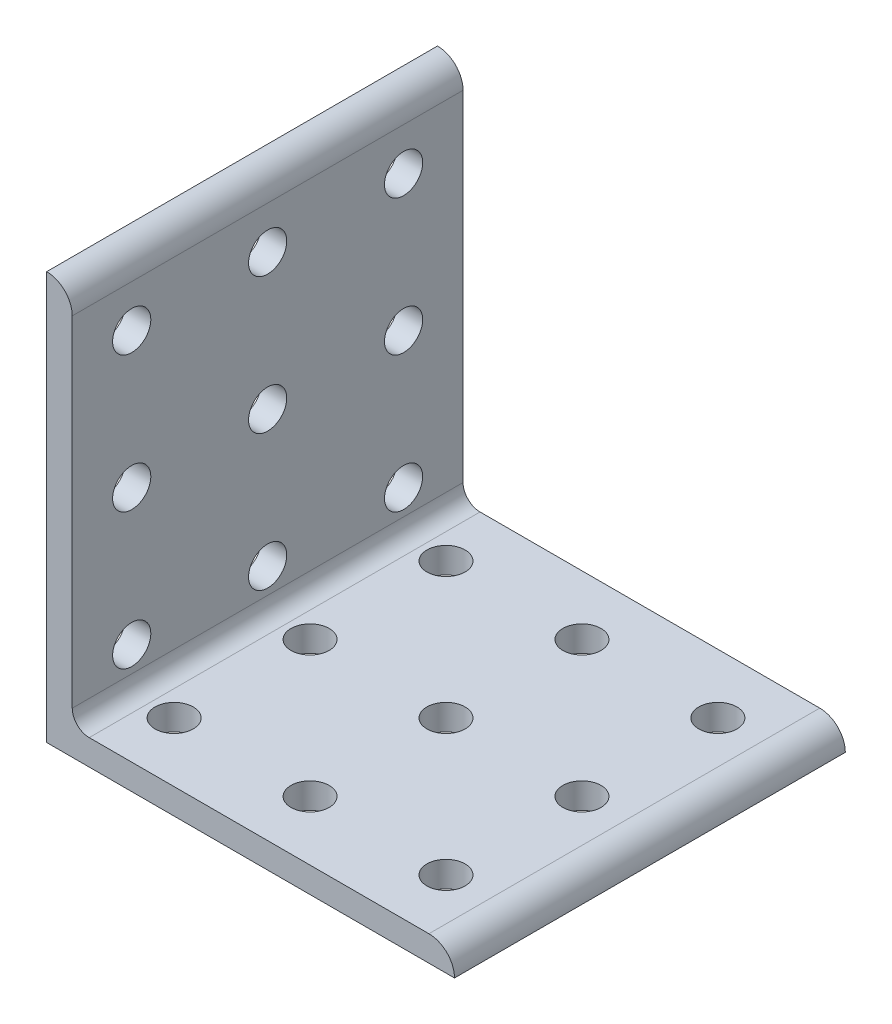
ISO-10303-21;
HEADER;
FILE_DESCRIPTION(('STEP AP214'),'2;1');
FILE_NAME('part.step','',(''),(''),'','','');
FILE_SCHEMA(('AUTOMOTIVE_DESIGN { 1 0 10303 214 1 1 1 1 }'));
ENDSEC;
DATA;
#1=APPLICATION_CONTEXT('core data for automotive mechanical design processes');
#2=APPLICATION_PROTOCOL_DEFINITION('international standard','automotive_design',2000,#1);
#3=PRODUCT_CONTEXT('',#1,'mechanical');
#4=PRODUCT('Part','Part','',(#3));
#5=PRODUCT_RELATED_PRODUCT_CATEGORY('part','',(#4));
#6=PRODUCT_DEFINITION_FORMATION('','',#4);
#7=PRODUCT_DEFINITION_CONTEXT('part definition',#1,'design');
#8=PRODUCT_DEFINITION('design','',#6,#7);
#9=PRODUCT_DEFINITION_SHAPE('','',#8);
#10=(LENGTH_UNIT() NAMED_UNIT(*) SI_UNIT(.MILLI.,.METRE.));
#11=(NAMED_UNIT(*) PLANE_ANGLE_UNIT() SI_UNIT($,.RADIAN.));
#12=(NAMED_UNIT(*) SI_UNIT($,.STERADIAN.) SOLID_ANGLE_UNIT());
#13=UNCERTAINTY_MEASURE_WITH_UNIT(LENGTH_MEASURE(1.E-05),#10,'distance_accuracy_value','');
#14=(GEOMETRIC_REPRESENTATION_CONTEXT(3) GLOBAL_UNCERTAINTY_ASSIGNED_CONTEXT((#13)) GLOBAL_UNIT_ASSIGNED_CONTEXT((#10,
#11,#12)) REPRESENTATION_CONTEXT('',''));
#15=CARTESIAN_POINT('',(0.,0.,0.));
#16=DIRECTION('',(0.,0.,1.));
#17=DIRECTION('',(1.,0.,0.));
#18=AXIS2_PLACEMENT_3D('',#15,#16,#17);
#19=CARTESIAN_POINT('',(-38.1,33.3248,-36.5125));
#20=DIRECTION('',(0.,0.,1.));
#21=DIRECTION('',(1.,0.,0.));
#22=AXIS2_PLACEMENT_3D('',#19,#20,#21);
#23=CYLINDRICAL_SURFACE('',#22,4.77519999999999);
#24=DIRECTION('',(0.,0.,1.));
#25=VECTOR('',#24,1.);
#26=CARTESIAN_POINT('',(-38.1,38.1,-36.5125));
#27=LINE('',#26,#25);
#28=CARTESIAN_POINT('',(-38.1,38.1,-36.5125));
#29=VERTEX_POINT('',#28);
#30=CARTESIAN_POINT('',(-38.1,38.1,36.5125));
#31=VERTEX_POINT('',#30);
#32=EDGE_CURVE('E43',#29,#31,#27,.T.);
#33=ORIENTED_EDGE('',*,*,#32,.T.);
#34=CARTESIAN_POINT('',(-38.1,33.3248,36.5125));
#35=DIRECTION('',(0.,0.,1.));
#36=DIRECTION('',(1.,0.,0.));
#37=AXIS2_PLACEMENT_3D('',#34,#35,#36);
#38=CIRCLE('',#37,4.77519999999999);
#39=CARTESIAN_POINT('',(-33.3248,33.3248,36.5125));
#40=VERTEX_POINT('',#39);
#41=EDGE_CURVE('E104',#40,#31,#38,.T.);
#42=ORIENTED_EDGE('',*,*,#41,.F.);
#43=DIRECTION('',(0.,0.,1.));
#44=VECTOR('',#43,1.);
#45=CARTESIAN_POINT('',(-33.3248,33.3248,-36.5125));
#46=LINE('',#45,#44);
#47=CARTESIAN_POINT('',(-33.3248,33.3248,-36.5125));
#48=VERTEX_POINT('',#47);
#49=EDGE_CURVE('E11',#48,#40,#46,.T.);
#50=ORIENTED_EDGE('',*,*,#49,.F.);
#51=CARTESIAN_POINT('',(-38.1,33.3248,-36.5125));
#52=DIRECTION('',(0.,0.,1.));
#53=DIRECTION('',(1.,0.,0.));
#54=AXIS2_PLACEMENT_3D('',#51,#52,#53);
#55=CIRCLE('',#54,4.77519999999999);
#56=EDGE_CURVE('E105',#48,#29,#55,.T.);
#57=ORIENTED_EDGE('',*,*,#56,.T.);
#58=EDGE_LOOP('',(#33,#42,#50,#57));
#59=FACE_BOUND('',#58,.T.);
#60=ADVANCED_FACE('F40',(#59),#23,.T.);
#61=CARTESIAN_POINT('',(-33.3248,-30.1498,-36.5125));
#62=DIRECTION('',(1.,0.,0.));
#63=DIRECTION('',(0.,1.,0.));
#64=AXIS2_PLACEMENT_3D('',#61,#62,#63);
#65=PLANE('',#64);
#66=CARTESIAN_POINT('',(-33.3248,-25.4,0.));
#67=DIRECTION('',(1.,0.,0.));
#68=DIRECTION('',(0.,1.,0.));
#69=AXIS2_PLACEMENT_3D('',#66,#67,#68);
#70=CIRCLE('',#69,3.5687);
#71=CARTESIAN_POINT('',(-33.3248,-21.8313,0.));
#72=VERTEX_POINT('',#71);
#73=EDGE_CURVE('E220',#72,#72,#70,.T.);
#74=ORIENTED_EDGE('',*,*,#73,.F.);
#75=EDGE_LOOP('',(#74));
#76=FACE_BOUND('',#75,.T.);
#77=CARTESIAN_POINT('',(-33.3248,-25.4,-25.4));
#78=DIRECTION('',(1.,0.,0.));
#79=DIRECTION('',(0.,1.,0.));
#80=AXIS2_PLACEMENT_3D('',#77,#78,#79);
#81=CIRCLE('',#80,3.5687);
#82=CARTESIAN_POINT('',(-33.3248,-21.8313,-25.4));
#83=VERTEX_POINT('',#82);
#84=EDGE_CURVE('E186',#83,#83,#81,.T.);
#85=ORIENTED_EDGE('',*,*,#84,.F.);
#86=EDGE_LOOP('',(#85));
#87=FACE_BOUND('',#86,.T.);
#88=CARTESIAN_POINT('',(-33.3248,0.,0.));
#89=DIRECTION('',(1.,0.,0.));
#90=DIRECTION('',(0.,1.,0.));
#91=AXIS2_PLACEMENT_3D('',#88,#89,#90);
#92=CIRCLE('',#91,3.5687);
#93=CARTESIAN_POINT('',(-33.3248,3.56869999999999,0.));
#94=VERTEX_POINT('',#93);
#95=EDGE_CURVE('E187',#94,#94,#92,.T.);
#96=ORIENTED_EDGE('',*,*,#95,.F.);
#97=EDGE_LOOP('',(#96));
#98=FACE_BOUND('',#97,.T.);
#99=CARTESIAN_POINT('',(-33.3248,0.,-25.3999999999999));
#100=DIRECTION('',(1.,0.,0.));
#101=DIRECTION('',(0.,1.,0.));
#102=AXIS2_PLACEMENT_3D('',#99,#100,#101);
#103=CIRCLE('',#102,3.5687);
#104=CARTESIAN_POINT('',(-33.3248,3.56869999999999,-25.3999999999999));
#105=VERTEX_POINT('',#104);
#106=EDGE_CURVE('E230',#105,#105,#103,.T.);
#107=ORIENTED_EDGE('',*,*,#106,.F.);
#108=EDGE_LOOP('',(#107));
#109=FACE_BOUND('',#108,.T.);
#110=CARTESIAN_POINT('',(-33.3248,25.4,1.76941794549634E-13));
#111=DIRECTION('',(1.,0.,0.));
#112=DIRECTION('',(0.,1.,0.));
#113=AXIS2_PLACEMENT_3D('',#110,#111,#112);
#114=CIRCLE('',#113,3.5687);
#115=CARTESIAN_POINT('',(-33.3248,28.9687,1.76941794549634E-13));
#116=VERTEX_POINT('',#115);
#117=EDGE_CURVE('E177',#116,#116,#114,.T.);
#118=ORIENTED_EDGE('',*,*,#117,.F.);
#119=EDGE_LOOP('',(#118));
#120=FACE_BOUND('',#119,.T.);
#121=CARTESIAN_POINT('',(-33.3248,25.4,-25.3999999999998));
#122=DIRECTION('',(1.,0.,0.));
#123=DIRECTION('',(0.,1.,0.));
#124=AXIS2_PLACEMENT_3D('',#121,#122,#123);
#125=CIRCLE('',#124,3.5687);
#126=CARTESIAN_POINT('',(-33.3248,28.9687,-25.3999999999998));
#127=VERTEX_POINT('',#126);
#128=EDGE_CURVE('E196',#127,#127,#125,.T.);
#129=ORIENTED_EDGE('',*,*,#128,.F.);
#130=EDGE_LOOP('',(#129));
#131=FACE_BOUND('',#130,.T.);
#132=CARTESIAN_POINT('',(-33.3248,0.,25.4000000000001));
#133=DIRECTION('',(1.,0.,0.));
#134=DIRECTION('',(0.,1.,0.));
#135=AXIS2_PLACEMENT_3D('',#132,#133,#134);
#136=CIRCLE('',#135,3.5687);
#137=CARTESIAN_POINT('',(-33.3248,3.56869999999999,25.4000000000001));
#138=VERTEX_POINT('',#137);
#139=EDGE_CURVE('E204',#138,#138,#136,.T.);
#140=ORIENTED_EDGE('',*,*,#139,.F.);
#141=EDGE_LOOP('',(#140));
#142=FACE_BOUND('',#141,.T.);
#143=CARTESIAN_POINT('',(-33.3248,25.4,25.4000000000002));
#144=DIRECTION('',(1.,0.,0.));
#145=DIRECTION('',(0.,1.,0.));
#146=AXIS2_PLACEMENT_3D('',#143,#144,#145);
#147=CIRCLE('',#146,3.5687);
#148=CARTESIAN_POINT('',(-33.3248,28.9687,25.4000000000002));
#149=VERTEX_POINT('',#148);
#150=EDGE_CURVE('E213',#149,#149,#147,.T.);
#151=ORIENTED_EDGE('',*,*,#150,.F.);
#152=EDGE_LOOP('',(#151));
#153=FACE_BOUND('',#152,.T.);
#154=CARTESIAN_POINT('',(-33.3248,-25.4,25.4));
#155=DIRECTION('',(1.,0.,0.));
#156=DIRECTION('',(0.,1.,0.));
#157=AXIS2_PLACEMENT_3D('',#154,#155,#156);
#158=CIRCLE('',#157,3.5687);
#159=CARTESIAN_POINT('',(-33.3248,-21.8313,25.4));
#160=VERTEX_POINT('',#159);
#161=EDGE_CURVE('E129',#160,#160,#158,.T.);
#162=ORIENTED_EDGE('',*,*,#161,.F.);
#163=EDGE_LOOP('',(#162));
#164=FACE_BOUND('',#163,.T.);
#165=ORIENTED_EDGE('',*,*,#49,.T.);
#166=DIRECTION('',(0.,1.,0.));
#167=VECTOR('',#166,1.);
#168=CARTESIAN_POINT('',(-33.3248,-30.1498,36.5125));
#169=LINE('',#168,#167);
#170=CARTESIAN_POINT('',(-33.3248,-30.1498,36.5125));
#171=VERTEX_POINT('',#170);
#172=EDGE_CURVE('E124',#171,#40,#169,.T.);
#173=ORIENTED_EDGE('',*,*,#172,.F.);
#174=DIRECTION('',(0.,0.,1.));
#175=VECTOR('',#174,1.);
#176=CARTESIAN_POINT('',(-33.3248,-30.1498,-36.5125));
#177=LINE('',#176,#175);
#178=CARTESIAN_POINT('',(-33.3248,-30.1498,-36.5125));
#179=VERTEX_POINT('',#178);
#180=EDGE_CURVE('E49',#179,#171,#177,.T.);
#181=ORIENTED_EDGE('',*,*,#180,.F.);
#182=DIRECTION('',(0.,1.,0.));
#183=VECTOR('',#182,1.);
#184=CARTESIAN_POINT('',(-33.3248,-30.1498,-36.5125));
#185=LINE('',#184,#183);
#186=EDGE_CURVE('E111',#179,#48,#185,.T.);
#187=ORIENTED_EDGE('',*,*,#186,.T.);
#188=EDGE_LOOP('',(#165,#173,#181,#187));
#189=FACE_BOUND('',#188,.T.);
#190=ADVANCED_FACE('F340',(#76,#87,#98,#109,#120,#131,#142,#153,#164,#189),#65,.T.);
#191=CARTESIAN_POINT('',(-30.1498,-30.1498,-36.5125));
#192=DIRECTION('',(0.,0.,1.));
#193=DIRECTION('',(1.,0.,0.));
#194=AXIS2_PLACEMENT_3D('',#191,#192,#193);
#195=CYLINDRICAL_SURFACE('',#194,3.175);
#196=ORIENTED_EDGE('',*,*,#180,.T.);
#197=CARTESIAN_POINT('',(-30.1498,-30.1498,36.5125));
#198=DIRECTION('',(0.,0.,-1.));
#199=DIRECTION('',(-1.,0.,0.));
#200=AXIS2_PLACEMENT_3D('',#197,#198,#199);
#201=CIRCLE('',#200,3.175);
#202=CARTESIAN_POINT('',(-30.1498,-33.3248,36.5125));
#203=VERTEX_POINT('',#202);
#204=EDGE_CURVE('E142',#203,#171,#201,.T.);
#205=ORIENTED_EDGE('',*,*,#204,.F.);
#206=DIRECTION('',(0.,0.,1.));
#207=VECTOR('',#206,1.);
#208=CARTESIAN_POINT('',(-30.1498,-33.3248,-36.5125));
#209=LINE('',#208,#207);
#210=CARTESIAN_POINT('',(-30.1498,-33.3248,-36.5125));
#211=VERTEX_POINT('',#210);
#212=EDGE_CURVE('E169',#211,#203,#209,.T.);
#213=ORIENTED_EDGE('',*,*,#212,.F.);
#214=CARTESIAN_POINT('',(-30.1498,-30.1498,-36.5125));
#215=DIRECTION('',(0.,0.,-1.));
#216=DIRECTION('',(-1.,0.,0.));
#217=AXIS2_PLACEMENT_3D('',#214,#215,#216);
#218=CIRCLE('',#217,3.175);
#219=EDGE_CURVE('E163',#211,#179,#218,.T.);
#220=ORIENTED_EDGE('',*,*,#219,.T.);
#221=EDGE_LOOP('',(#196,#205,#213,#220));
#222=FACE_BOUND('',#221,.T.);
#223=ADVANCED_FACE('F320',(#222),#195,.F.);
#224=CARTESIAN_POINT('',(33.3248,-33.3248,-36.5125));
#225=DIRECTION('',(0.,1.,0.));
#226=DIRECTION('',(-1.,0.,0.));
#227=AXIS2_PLACEMENT_3D('',#224,#225,#226);
#228=PLANE('',#227);
#229=CARTESIAN_POINT('',(0.,-33.3248,25.4));
#230=DIRECTION('',(0.,1.,0.));
#231=DIRECTION('',(-1.,0.,0.));
#232=AXIS2_PLACEMENT_3D('',#229,#230,#231);
#233=CIRCLE('',#232,3.5687);
#234=CARTESIAN_POINT('',(-3.5687,-33.3248,25.4));
#235=VERTEX_POINT('',#234);
#236=EDGE_CURVE('E270',#235,#235,#233,.T.);
#237=ORIENTED_EDGE('',*,*,#236,.F.);
#238=EDGE_LOOP('',(#237));
#239=FACE_BOUND('',#238,.T.);
#240=CARTESIAN_POINT('',(25.4,-33.3248,25.4));
#241=DIRECTION('',(0.,1.,0.));
#242=DIRECTION('',(-1.,0.,0.));
#243=AXIS2_PLACEMENT_3D('',#240,#241,#242);
#244=CIRCLE('',#243,3.5687);
#245=CARTESIAN_POINT('',(21.8313,-33.3248,25.4));
#246=VERTEX_POINT('',#245);
#247=EDGE_CURVE('E264',#246,#246,#244,.T.);
#248=ORIENTED_EDGE('',*,*,#247,.F.);
#249=EDGE_LOOP('',(#248));
#250=FACE_BOUND('',#249,.T.);
#251=CARTESIAN_POINT('',(0.,-33.3248,0.));
#252=DIRECTION('',(0.,1.,0.));
#253=DIRECTION('',(-1.,0.,0.));
#254=AXIS2_PLACEMENT_3D('',#251,#252,#253);
#255=CIRCLE('',#254,3.5687);
#256=CARTESIAN_POINT('',(-3.56870000000009,-33.3248,0.));
#257=VERTEX_POINT('',#256);
#258=EDGE_CURVE('E256',#257,#257,#255,.T.);
#259=ORIENTED_EDGE('',*,*,#258,.F.);
#260=EDGE_LOOP('',(#259));
#261=FACE_BOUND('',#260,.T.);
#262=CARTESIAN_POINT('',(25.3999999999999,-33.3248,0.));
#263=DIRECTION('',(0.,1.,0.));
#264=DIRECTION('',(-1.,0.,0.));
#265=AXIS2_PLACEMENT_3D('',#262,#263,#264);
#266=CIRCLE('',#265,3.5687);
#267=CARTESIAN_POINT('',(21.8312999999999,-33.3248,0.));
#268=VERTEX_POINT('',#267);
#269=EDGE_CURVE('E249',#268,#268,#266,.T.);
#270=ORIENTED_EDGE('',*,*,#269,.F.);
#271=EDGE_LOOP('',(#270));
#272=FACE_BOUND('',#271,.T.);
#273=CARTESIAN_POINT('',(-1.76941794549634E-13,-33.3248,-25.4));
#274=DIRECTION('',(0.,1.,0.));
#275=DIRECTION('',(-1.,0.,0.));
#276=AXIS2_PLACEMENT_3D('',#273,#274,#275);
#277=CIRCLE('',#276,3.5687);
#278=CARTESIAN_POINT('',(-3.56870000000018,-33.3248,-25.4));
#279=VERTEX_POINT('',#278);
#280=EDGE_CURVE('E297',#279,#279,#277,.T.);
#281=ORIENTED_EDGE('',*,*,#280,.F.);
#282=EDGE_LOOP('',(#281));
#283=FACE_BOUND('',#282,.T.);
#284=CARTESIAN_POINT('',(25.3999999999998,-33.3248,-25.4));
#285=DIRECTION('',(0.,1.,0.));
#286=DIRECTION('',(-1.,0.,0.));
#287=AXIS2_PLACEMENT_3D('',#284,#285,#286);
#288=CIRCLE('',#287,3.5687);
#289=CARTESIAN_POINT('',(21.8312999999998,-33.3248,-25.4));
#290=VERTEX_POINT('',#289);
#291=EDGE_CURVE('E291',#290,#290,#288,.T.);
#292=ORIENTED_EDGE('',*,*,#291,.F.);
#293=EDGE_LOOP('',(#292));
#294=FACE_BOUND('',#293,.T.);
#295=CARTESIAN_POINT('',(-25.4000000000001,-33.3248,0.));
#296=DIRECTION('',(0.,1.,0.));
#297=DIRECTION('',(-1.,0.,0.));
#298=AXIS2_PLACEMENT_3D('',#295,#296,#297);
#299=CIRCLE('',#298,3.5687);
#300=CARTESIAN_POINT('',(-28.9687000000001,-33.3248,0.));
#301=VERTEX_POINT('',#300);
#302=EDGE_CURVE('E283',#301,#301,#299,.T.);
#303=ORIENTED_EDGE('',*,*,#302,.F.);
#304=EDGE_LOOP('',(#303));
#305=FACE_BOUND('',#304,.T.);
#306=CARTESIAN_POINT('',(-25.4000000000002,-33.3248,-25.4));
#307=DIRECTION('',(0.,1.,0.));
#308=DIRECTION('',(-1.,0.,0.));
#309=AXIS2_PLACEMENT_3D('',#306,#307,#308);
#310=CIRCLE('',#309,3.5687);
#311=CARTESIAN_POINT('',(-28.9687000000002,-33.3248,-25.4));
#312=VERTEX_POINT('',#311);
#313=EDGE_CURVE('E277',#312,#312,#310,.T.);
#314=ORIENTED_EDGE('',*,*,#313,.F.);
#315=EDGE_LOOP('',(#314));
#316=FACE_BOUND('',#315,.T.);
#317=CARTESIAN_POINT('',(-25.4,-33.3248,25.4));
#318=DIRECTION('',(0.,1.,0.));
#319=DIRECTION('',(-1.,0.,0.));
#320=AXIS2_PLACEMENT_3D('',#317,#318,#319);
#321=CIRCLE('',#320,3.5687);
#322=CARTESIAN_POINT('',(-28.9687,-33.3248,25.4));
#323=VERTEX_POINT('',#322);
#324=EDGE_CURVE('E241',#323,#323,#321,.T.);
#325=ORIENTED_EDGE('',*,*,#324,.F.);
#326=EDGE_LOOP('',(#325));
#327=FACE_BOUND('',#326,.T.);
#328=ORIENTED_EDGE('',*,*,#212,.T.);
#329=DIRECTION('',(-1.,0.,0.));
#330=VECTOR('',#329,1.);
#331=CARTESIAN_POINT('',(33.3248,-33.3248,36.5125));
#332=LINE('',#331,#330);
#333=CARTESIAN_POINT('',(33.3248,-33.3248,36.5125));
#334=VERTEX_POINT('',#333);
#335=EDGE_CURVE('E138',#334,#203,#332,.T.);
#336=ORIENTED_EDGE('',*,*,#335,.F.);
#337=DIRECTION('',(0.,0.,1.));
#338=VECTOR('',#337,1.);
#339=CARTESIAN_POINT('',(33.3248,-33.3248,-36.5125));
#340=LINE('',#339,#338);
#341=CARTESIAN_POINT('',(33.3248,-33.3248,-36.5125));
#342=VERTEX_POINT('',#341);
#343=EDGE_CURVE('E172',#342,#334,#340,.T.);
#344=ORIENTED_EDGE('',*,*,#343,.F.);
#345=DIRECTION('',(-1.,0.,0.));
#346=VECTOR('',#345,1.);
#347=CARTESIAN_POINT('',(33.3248,-33.3248,-36.5125));
#348=LINE('',#347,#346);
#349=EDGE_CURVE('E159',#342,#211,#348,.T.);
#350=ORIENTED_EDGE('',*,*,#349,.T.);
#351=EDGE_LOOP('',(#328,#336,#344,#350));
#352=FACE_BOUND('',#351,.T.);
#353=ADVANCED_FACE('F316',(#239,#250,#261,#272,#283,#294,#305,#316,#327,#352),#228,.T.);
#354=CARTESIAN_POINT('',(33.3248,-38.1,-36.5125));
#355=DIRECTION('',(0.,0.,1.));
#356=DIRECTION('',(1.,0.,0.));
#357=AXIS2_PLACEMENT_3D('',#354,#355,#356);
#358=CYLINDRICAL_SURFACE('',#357,4.77519999999998);
#359=ORIENTED_EDGE('',*,*,#343,.T.);
#360=CARTESIAN_POINT('',(33.3248,-38.1,36.5125));
#361=DIRECTION('',(0.,0.,1.));
#362=DIRECTION('',(-1.,0.,0.));
#363=AXIS2_PLACEMENT_3D('',#360,#361,#362);
#364=CIRCLE('',#363,4.77519999999998);
#365=CARTESIAN_POINT('',(38.1,-38.1,36.5125));
#366=VERTEX_POINT('',#365);
#367=EDGE_CURVE('E135',#366,#334,#364,.T.);
#368=ORIENTED_EDGE('',*,*,#367,.F.);
#369=DIRECTION('',(0.,0.,1.));
#370=VECTOR('',#369,1.);
#371=CARTESIAN_POINT('',(38.1,-38.1,-36.5125));
#372=LINE('',#371,#370);
#373=CARTESIAN_POINT('',(38.1,-38.1,-36.5125));
#374=VERTEX_POINT('',#373);
#375=EDGE_CURVE('E174',#374,#366,#372,.T.);
#376=ORIENTED_EDGE('',*,*,#375,.F.);
#377=CARTESIAN_POINT('',(33.3248,-38.1,-36.5125));
#378=DIRECTION('',(0.,0.,1.));
#379=DIRECTION('',(-1.,0.,0.));
#380=AXIS2_PLACEMENT_3D('',#377,#378,#379);
#381=CIRCLE('',#380,4.77519999999998);
#382=EDGE_CURVE('E156',#374,#342,#381,.T.);
#383=ORIENTED_EDGE('',*,*,#382,.T.);
#384=EDGE_LOOP('',(#359,#368,#376,#383));
#385=FACE_BOUND('',#384,.T.);
#386=ADVANCED_FACE('F319',(#385),#358,.T.);
#387=CARTESIAN_POINT('',(-38.1,-38.1,-36.5125));
#388=DIRECTION('',(0.,-1.,0.));
#389=DIRECTION('',(1.,0.,0.));
#390=AXIS2_PLACEMENT_3D('',#387,#388,#389);
#391=PLANE('',#390);
#392=CARTESIAN_POINT('',(0.,-38.1,25.4));
#393=DIRECTION('',(0.,1.,0.));
#394=DIRECTION('',(-1.,0.,0.));
#395=AXIS2_PLACEMENT_3D('',#392,#393,#394);
#396=CIRCLE('',#395,3.5687);
#397=CARTESIAN_POINT('',(-3.5687,-38.1,25.4));
#398=VERTEX_POINT('',#397);
#399=EDGE_CURVE('E245',#398,#398,#396,.T.);
#400=ORIENTED_EDGE('',*,*,#399,.T.);
#401=EDGE_LOOP('',(#400));
#402=FACE_BOUND('',#401,.T.);
#403=CARTESIAN_POINT('',(25.4,-38.1,25.4));
#404=DIRECTION('',(0.,1.,0.));
#405=DIRECTION('',(-1.,0.,0.));
#406=AXIS2_PLACEMENT_3D('',#403,#404,#405);
#407=CIRCLE('',#406,3.5687);
#408=CARTESIAN_POINT('',(21.8313,-38.1,25.4));
#409=VERTEX_POINT('',#408);
#410=EDGE_CURVE('E267',#409,#409,#407,.T.);
#411=ORIENTED_EDGE('',*,*,#410,.T.);
#412=EDGE_LOOP('',(#411));
#413=FACE_BOUND('',#412,.T.);
#414=CARTESIAN_POINT('',(0.,-38.1,0.));
#415=DIRECTION('',(0.,1.,0.));
#416=DIRECTION('',(-1.,0.,0.));
#417=AXIS2_PLACEMENT_3D('',#414,#415,#416);
#418=CIRCLE('',#417,3.5687);
#419=CARTESIAN_POINT('',(-3.56870000000009,-38.1,0.));
#420=VERTEX_POINT('',#419);
#421=EDGE_CURVE('E260',#420,#420,#418,.T.);
#422=ORIENTED_EDGE('',*,*,#421,.T.);
#423=EDGE_LOOP('',(#422));
#424=FACE_BOUND('',#423,.T.);
#425=CARTESIAN_POINT('',(25.3999999999999,-38.1,0.));
#426=DIRECTION('',(0.,1.,0.));
#427=DIRECTION('',(-1.,0.,0.));
#428=AXIS2_PLACEMENT_3D('',#425,#426,#427);
#429=CIRCLE('',#428,3.5687);
#430=CARTESIAN_POINT('',(21.8312999999999,-38.1,0.));
#431=VERTEX_POINT('',#430);
#432=EDGE_CURVE('E252',#431,#431,#429,.T.);
#433=ORIENTED_EDGE('',*,*,#432,.T.);
#434=EDGE_LOOP('',(#433));
#435=FACE_BOUND('',#434,.T.);
#436=CARTESIAN_POINT('',(-1.7641978092261E-13,-38.1,-25.4));
#437=DIRECTION('',(0.,1.,0.));
#438=DIRECTION('',(-1.,0.,0.));
#439=AXIS2_PLACEMENT_3D('',#436,#437,#438);
#440=CIRCLE('',#439,3.5687);
#441=CARTESIAN_POINT('',(-3.56870000000018,-38.1,-25.4));
#442=VERTEX_POINT('',#441);
#443=EDGE_CURVE('E253',#442,#442,#440,.T.);
#444=ORIENTED_EDGE('',*,*,#443,.T.);
#445=EDGE_LOOP('',(#444));
#446=FACE_BOUND('',#445,.T.);
#447=CARTESIAN_POINT('',(25.3999999999998,-38.1,-25.4));
#448=DIRECTION('',(0.,1.,0.));
#449=DIRECTION('',(-1.,0.,0.));
#450=AXIS2_PLACEMENT_3D('',#447,#448,#449);
#451=CIRCLE('',#450,3.5687);
#452=CARTESIAN_POINT('',(21.8312999999998,-38.1,-25.4));
#453=VERTEX_POINT('',#452);
#454=EDGE_CURVE('E294',#453,#453,#451,.T.);
#455=ORIENTED_EDGE('',*,*,#454,.T.);
#456=EDGE_LOOP('',(#455));
#457=FACE_BOUND('',#456,.T.);
#458=CARTESIAN_POINT('',(-25.4000000000001,-38.1,0.));
#459=DIRECTION('',(0.,1.,0.));
#460=DIRECTION('',(-1.,0.,0.));
#461=AXIS2_PLACEMENT_3D('',#458,#459,#460);
#462=CIRCLE('',#461,3.5687);
#463=CARTESIAN_POINT('',(-28.9687000000001,-38.1,0.));
#464=VERTEX_POINT('',#463);
#465=EDGE_CURVE('E287',#464,#464,#462,.T.);
#466=ORIENTED_EDGE('',*,*,#465,.T.);
#467=EDGE_LOOP('',(#466));
#468=FACE_BOUND('',#467,.T.);
#469=CARTESIAN_POINT('',(-25.4000000000002,-38.1,-25.4));
#470=DIRECTION('',(0.,1.,0.));
#471=DIRECTION('',(-1.,0.,0.));
#472=AXIS2_PLACEMENT_3D('',#469,#470,#471);
#473=CIRCLE('',#472,3.5687);
#474=CARTESIAN_POINT('',(-28.9687000000002,-38.1,-25.4));
#475=VERTEX_POINT('',#474);
#476=EDGE_CURVE('E280',#475,#475,#473,.T.);
#477=ORIENTED_EDGE('',*,*,#476,.T.);
#478=EDGE_LOOP('',(#477));
#479=FACE_BOUND('',#478,.T.);
#480=CARTESIAN_POINT('',(-25.4,-38.1,25.4));
#481=DIRECTION('',(0.,1.,0.));
#482=DIRECTION('',(-1.,0.,0.));
#483=AXIS2_PLACEMENT_3D('',#480,#481,#482);
#484=CIRCLE('',#483,3.5687);
#485=CARTESIAN_POINT('',(-28.9687,-38.1,25.4));
#486=VERTEX_POINT('',#485);
#487=EDGE_CURVE('E217',#486,#486,#484,.T.);
#488=ORIENTED_EDGE('',*,*,#487,.T.);
#489=EDGE_LOOP('',(#488));
#490=FACE_BOUND('',#489,.T.);
#491=ORIENTED_EDGE('',*,*,#375,.T.);
#492=DIRECTION('',(1.,0.,0.));
#493=VECTOR('',#492,1.);
#494=CARTESIAN_POINT('',(-38.1,-38.1,36.5125));
#495=LINE('',#494,#493);
#496=CARTESIAN_POINT('',(-38.1,-38.1,36.5125));
#497=VERTEX_POINT('',#496);
#498=EDGE_CURVE('E119',#497,#366,#495,.T.);
#499=ORIENTED_EDGE('',*,*,#498,.F.);
#500=DIRECTION('',(0.,0.,1.));
#501=VECTOR('',#500,1.);
#502=CARTESIAN_POINT('',(-38.1,-38.1,-36.5125));
#503=LINE('',#502,#501);
#504=CARTESIAN_POINT('',(-38.1,-38.1,-36.5125));
#505=VERTEX_POINT('',#504);
#506=EDGE_CURVE('E110',#505,#497,#503,.T.);
#507=ORIENTED_EDGE('',*,*,#506,.F.);
#508=DIRECTION('',(1.,0.,0.));
#509=VECTOR('',#508,1.);
#510=CARTESIAN_POINT('',(-38.1,-38.1,-36.5125));
#511=LINE('',#510,#509);
#512=EDGE_CURVE('E152',#505,#374,#511,.T.);
#513=ORIENTED_EDGE('',*,*,#512,.T.);
#514=EDGE_LOOP('',(#491,#499,#507,#513));
#515=FACE_BOUND('',#514,.T.);
#516=ADVANCED_FACE('F305',(#402,#413,#424,#435,#446,#457,#468,#479,#490,#515),#391,.T.);
#517=CARTESIAN_POINT('',(-38.1,38.1,-36.5125));
#518=DIRECTION('',(-1.,0.,0.));
#519=DIRECTION('',(0.,-1.,0.));
#520=AXIS2_PLACEMENT_3D('',#517,#518,#519);
#521=PLANE('',#520);
#522=CARTESIAN_POINT('',(-38.1,-25.4,0.));
#523=DIRECTION('',(1.,0.,0.));
#524=DIRECTION('',(0.,1.,0.));
#525=AXIS2_PLACEMENT_3D('',#522,#523,#524);
#526=CIRCLE('',#525,3.5687);
#527=CARTESIAN_POINT('',(-38.1,-21.8313,0.));
#528=VERTEX_POINT('',#527);
#529=EDGE_CURVE('E182',#528,#528,#526,.T.);
#530=ORIENTED_EDGE('',*,*,#529,.T.);
#531=EDGE_LOOP('',(#530));
#532=FACE_BOUND('',#531,.T.);
#533=CARTESIAN_POINT('',(-38.1,-25.4,-25.4));
#534=DIRECTION('',(1.,0.,0.));
#535=DIRECTION('',(0.,1.,0.));
#536=AXIS2_PLACEMENT_3D('',#533,#534,#535);
#537=CIRCLE('',#536,3.5687);
#538=CARTESIAN_POINT('',(-38.1,-21.8313,-25.4));
#539=VERTEX_POINT('',#538);
#540=EDGE_CURVE('E223',#539,#539,#537,.T.);
#541=ORIENTED_EDGE('',*,*,#540,.T.);
#542=EDGE_LOOP('',(#541));
#543=FACE_BOUND('',#542,.T.);
#544=CARTESIAN_POINT('',(-38.1,0.,0.));
#545=DIRECTION('',(1.,0.,0.));
#546=DIRECTION('',(0.,1.,0.));
#547=AXIS2_PLACEMENT_3D('',#544,#545,#546);
#548=CIRCLE('',#547,3.5687);
#549=CARTESIAN_POINT('',(-38.1,3.56869999999999,0.));
#550=VERTEX_POINT('',#549);
#551=EDGE_CURVE('E183',#550,#550,#548,.T.);
#552=ORIENTED_EDGE('',*,*,#551,.T.);
#553=EDGE_LOOP('',(#552));
#554=FACE_BOUND('',#553,.T.);
#555=CARTESIAN_POINT('',(-38.1,0.,-25.3999999999999));
#556=DIRECTION('',(1.,0.,0.));
#557=DIRECTION('',(0.,1.,0.));
#558=AXIS2_PLACEMENT_3D('',#555,#556,#557);
#559=CIRCLE('',#558,3.5687);
#560=CARTESIAN_POINT('',(-38.1,3.56869999999999,-25.3999999999999));
#561=VERTEX_POINT('',#560);
#562=EDGE_CURVE('E191',#561,#561,#559,.T.);
#563=ORIENTED_EDGE('',*,*,#562,.T.);
#564=EDGE_LOOP('',(#563));
#565=FACE_BOUND('',#564,.T.);
#566=CARTESIAN_POINT('',(-38.1,25.4,1.76941794549634E-13));
#567=DIRECTION('',(1.,0.,0.));
#568=DIRECTION('',(0.,1.,0.));
#569=AXIS2_PLACEMENT_3D('',#566,#567,#568);
#570=CIRCLE('',#569,3.5687);
#571=CARTESIAN_POINT('',(-38.1,28.9687,1.76941794549634E-13));
#572=VERTEX_POINT('',#571);
#573=EDGE_CURVE('E232',#572,#572,#570,.T.);
#574=ORIENTED_EDGE('',*,*,#573,.T.);
#575=EDGE_LOOP('',(#574));
#576=FACE_BOUND('',#575,.T.);
#577=CARTESIAN_POINT('',(-38.1,25.4,-25.3999999999998));
#578=DIRECTION('',(1.,0.,0.));
#579=DIRECTION('',(0.,1.,0.));
#580=AXIS2_PLACEMENT_3D('',#577,#578,#579);
#581=CIRCLE('',#580,3.5687);
#582=CARTESIAN_POINT('',(-38.1,28.9687,-25.3999999999998));
#583=VERTEX_POINT('',#582);
#584=EDGE_CURVE('E193',#583,#583,#581,.T.);
#585=ORIENTED_EDGE('',*,*,#584,.T.);
#586=EDGE_LOOP('',(#585));
#587=FACE_BOUND('',#586,.T.);
#588=CARTESIAN_POINT('',(-38.1,0.,25.4000000000001));
#589=DIRECTION('',(1.,0.,0.));
#590=DIRECTION('',(0.,1.,0.));
#591=AXIS2_PLACEMENT_3D('',#588,#589,#590);
#592=CIRCLE('',#591,3.5687);
#593=CARTESIAN_POINT('',(-38.1,3.56869999999999,25.4000000000001));
#594=VERTEX_POINT('',#593);
#595=EDGE_CURVE('E199',#594,#594,#592,.T.);
#596=ORIENTED_EDGE('',*,*,#595,.T.);
#597=EDGE_LOOP('',(#596));
#598=FACE_BOUND('',#597,.T.);
#599=CARTESIAN_POINT('',(-38.1,25.4,25.4000000000002));
#600=DIRECTION('',(1.,0.,0.));
#601=DIRECTION('',(0.,1.,0.));
#602=AXIS2_PLACEMENT_3D('',#599,#600,#601);
#603=CIRCLE('',#602,3.5687);
#604=CARTESIAN_POINT('',(-38.1,28.9687,25.4000000000002));
#605=VERTEX_POINT('',#604);
#606=EDGE_CURVE('E210',#605,#605,#603,.T.);
#607=ORIENTED_EDGE('',*,*,#606,.T.);
#608=EDGE_LOOP('',(#607));
#609=FACE_BOUND('',#608,.T.);
#610=CARTESIAN_POINT('',(-38.1,-25.4,25.4));
#611=DIRECTION('',(1.,0.,0.));
#612=DIRECTION('',(0.,1.,0.));
#613=AXIS2_PLACEMENT_3D('',#610,#611,#612);
#614=CIRCLE('',#613,3.5687);
#615=CARTESIAN_POINT('',(-38.1,-21.8313,25.4));
#616=VERTEX_POINT('',#615);
#617=EDGE_CURVE('E125',#616,#616,#614,.T.);
#618=ORIENTED_EDGE('',*,*,#617,.T.);
#619=EDGE_LOOP('',(#618));
#620=FACE_BOUND('',#619,.T.);
#621=ORIENTED_EDGE('',*,*,#506,.T.);
#622=DIRECTION('',(0.,-1.,0.));
#623=VECTOR('',#622,1.);
#624=CARTESIAN_POINT('',(-38.1,38.1,36.5125));
#625=LINE('',#624,#623);
#626=EDGE_CURVE('E113',#31,#497,#625,.T.);
#627=ORIENTED_EDGE('',*,*,#626,.F.);
#628=ORIENTED_EDGE('',*,*,#32,.F.);
#629=DIRECTION('',(0.,-1.,0.));
#630=VECTOR('',#629,1.);
#631=CARTESIAN_POINT('',(-38.1,38.1,-36.5125));
#632=LINE('',#631,#630);
#633=EDGE_CURVE('E149',#29,#505,#632,.T.);
#634=ORIENTED_EDGE('',*,*,#633,.T.);
#635=EDGE_LOOP('',(#621,#627,#628,#634));
#636=FACE_BOUND('',#635,.T.);
#637=ADVANCED_FACE('F114',(#532,#543,#554,#565,#576,#587,#598,#609,#620,#636),#521,.T.);
#638=CARTESIAN_POINT('',(-38.1,33.3248,-36.5125));
#639=DIRECTION('',(0.,0.,1.));
#640=DIRECTION('',(1.,0.,0.));
#641=AXIS2_PLACEMENT_3D('',#638,#639,#640);
#642=PLANE('',#641);
#643=ORIENTED_EDGE('',*,*,#56,.F.);
#644=ORIENTED_EDGE('',*,*,#186,.F.);
#645=ORIENTED_EDGE('',*,*,#219,.F.);
#646=ORIENTED_EDGE('',*,*,#349,.F.);
#647=ORIENTED_EDGE('',*,*,#382,.F.);
#648=ORIENTED_EDGE('',*,*,#512,.F.);
#649=ORIENTED_EDGE('',*,*,#633,.F.);
#650=EDGE_LOOP('',(#643,#644,#645,#646,#647,#648,#649));
#651=FACE_BOUND('',#650,.T.);
#652=ADVANCED_FACE('F339',(#651),#642,.F.);
#653=CARTESIAN_POINT('',(-38.1,33.3248,36.5125));
#654=DIRECTION('',(0.,0.,1.));
#655=DIRECTION('',(1.,0.,0.));
#656=AXIS2_PLACEMENT_3D('',#653,#654,#655);
#657=PLANE('',#656);
#658=ORIENTED_EDGE('',*,*,#41,.T.);
#659=ORIENTED_EDGE('',*,*,#626,.T.);
#660=ORIENTED_EDGE('',*,*,#498,.T.);
#661=ORIENTED_EDGE('',*,*,#367,.T.);
#662=ORIENTED_EDGE('',*,*,#335,.T.);
#663=ORIENTED_EDGE('',*,*,#204,.T.);
#664=ORIENTED_EDGE('',*,*,#172,.T.);
#665=EDGE_LOOP('',(#658,#659,#660,#661,#662,#663,#664));
#666=FACE_BOUND('',#665,.T.);
#667=ADVANCED_FACE('F122',(#666),#657,.T.);
#668=CARTESIAN_POINT('',(-38.1,-25.4,25.4));
#669=DIRECTION('',(1.,0.,0.));
#670=DIRECTION('',(0.,1.,0.));
#671=AXIS2_PLACEMENT_3D('',#668,#669,#670);
#672=CYLINDRICAL_SURFACE('',#671,3.5687);
#673=ORIENTED_EDGE('',*,*,#617,.F.);
#674=EDGE_LOOP('',(#673));
#675=FACE_BOUND('',#674,.T.);
#676=ORIENTED_EDGE('',*,*,#161,.T.);
#677=EDGE_LOOP('',(#676));
#678=FACE_BOUND('',#677,.T.);
#679=ADVANCED_FACE('F380',(#675,#678),#672,.F.);
#680=CARTESIAN_POINT('',(-38.1,25.4,25.4000000000002));
#681=DIRECTION('',(1.,0.,0.));
#682=DIRECTION('',(0.,1.,0.));
#683=AXIS2_PLACEMENT_3D('',#680,#681,#682);
#684=CYLINDRICAL_SURFACE('',#683,3.5687);
#685=ORIENTED_EDGE('',*,*,#606,.F.);
#686=EDGE_LOOP('',(#685));
#687=FACE_BOUND('',#686,.T.);
#688=ORIENTED_EDGE('',*,*,#150,.T.);
#689=EDGE_LOOP('',(#688));
#690=FACE_BOUND('',#689,.T.);
#691=ADVANCED_FACE('F383',(#687,#690),#684,.F.);
#692=CARTESIAN_POINT('',(-38.1,0.,25.4000000000001));
#693=DIRECTION('',(1.,0.,0.));
#694=DIRECTION('',(0.,1.,0.));
#695=AXIS2_PLACEMENT_3D('',#692,#693,#694);
#696=CYLINDRICAL_SURFACE('',#695,3.5687);
#697=ORIENTED_EDGE('',*,*,#595,.F.);
#698=EDGE_LOOP('',(#697));
#699=FACE_BOUND('',#698,.T.);
#700=ORIENTED_EDGE('',*,*,#139,.T.);
#701=EDGE_LOOP('',(#700));
#702=FACE_BOUND('',#701,.T.);
#703=ADVANCED_FACE('F391',(#699,#702),#696,.F.);
#704=CARTESIAN_POINT('',(-38.1,25.4,-25.3999999999998));
#705=DIRECTION('',(1.,0.,0.));
#706=DIRECTION('',(0.,1.,0.));
#707=AXIS2_PLACEMENT_3D('',#704,#705,#706);
#708=CYLINDRICAL_SURFACE('',#707,3.5687);
#709=ORIENTED_EDGE('',*,*,#584,.F.);
#710=EDGE_LOOP('',(#709));
#711=FACE_BOUND('',#710,.T.);
#712=ORIENTED_EDGE('',*,*,#128,.T.);
#713=EDGE_LOOP('',(#712));
#714=FACE_BOUND('',#713,.T.);
#715=ADVANCED_FACE('F415',(#711,#714),#708,.F.);
#716=CARTESIAN_POINT('',(-38.1,25.4,1.76941794549634E-13));
#717=DIRECTION('',(1.,0.,0.));
#718=DIRECTION('',(0.,1.,0.));
#719=AXIS2_PLACEMENT_3D('',#716,#717,#718);
#720=CYLINDRICAL_SURFACE('',#719,3.5687);
#721=ORIENTED_EDGE('',*,*,#573,.F.);
#722=EDGE_LOOP('',(#721));
#723=FACE_BOUND('',#722,.T.);
#724=ORIENTED_EDGE('',*,*,#117,.T.);
#725=EDGE_LOOP('',(#724));
#726=FACE_BOUND('',#725,.T.);
#727=ADVANCED_FACE('F399',(#723,#726),#720,.F.);
#728=CARTESIAN_POINT('',(-38.1,0.,-25.3999999999999));
#729=DIRECTION('',(1.,0.,0.));
#730=DIRECTION('',(0.,1.,0.));
#731=AXIS2_PLACEMENT_3D('',#728,#729,#730);
#732=CYLINDRICAL_SURFACE('',#731,3.5687);
#733=ORIENTED_EDGE('',*,*,#562,.F.);
#734=EDGE_LOOP('',(#733));
#735=FACE_BOUND('',#734,.T.);
#736=ORIENTED_EDGE('',*,*,#106,.T.);
#737=EDGE_LOOP('',(#736));
#738=FACE_BOUND('',#737,.T.);
#739=ADVANCED_FACE('F395',(#735,#738),#732,.F.);
#740=CARTESIAN_POINT('',(-38.1,0.,0.));
#741=DIRECTION('',(1.,0.,0.));
#742=DIRECTION('',(0.,1.,0.));
#743=AXIS2_PLACEMENT_3D('',#740,#741,#742);
#744=CYLINDRICAL_SURFACE('',#743,3.5687);
#745=ORIENTED_EDGE('',*,*,#551,.F.);
#746=EDGE_LOOP('',(#745));
#747=FACE_BOUND('',#746,.T.);
#748=ORIENTED_EDGE('',*,*,#95,.T.);
#749=EDGE_LOOP('',(#748));
#750=FACE_BOUND('',#749,.T.);
#751=ADVANCED_FACE('F398',(#747,#750),#744,.F.);
#752=CARTESIAN_POINT('',(-38.1,-25.4,-25.4));
#753=DIRECTION('',(1.,0.,0.));
#754=DIRECTION('',(0.,1.,0.));
#755=AXIS2_PLACEMENT_3D('',#752,#753,#754);
#756=CYLINDRICAL_SURFACE('',#755,3.5687);
#757=ORIENTED_EDGE('',*,*,#540,.F.);
#758=EDGE_LOOP('',(#757));
#759=FACE_BOUND('',#758,.T.);
#760=ORIENTED_EDGE('',*,*,#84,.T.);
#761=EDGE_LOOP('',(#760));
#762=FACE_BOUND('',#761,.T.);
#763=ADVANCED_FACE('F403',(#759,#762),#756,.F.);
#764=CARTESIAN_POINT('',(-38.1,-25.4,0.));
#765=DIRECTION('',(1.,0.,0.));
#766=DIRECTION('',(0.,1.,0.));
#767=AXIS2_PLACEMENT_3D('',#764,#765,#766);
#768=CYLINDRICAL_SURFACE('',#767,3.5687);
#769=ORIENTED_EDGE('',*,*,#529,.F.);
#770=EDGE_LOOP('',(#769));
#771=FACE_BOUND('',#770,.T.);
#772=ORIENTED_EDGE('',*,*,#73,.T.);
#773=EDGE_LOOP('',(#772));
#774=FACE_BOUND('',#773,.T.);
#775=ADVANCED_FACE('F407',(#771,#774),#768,.F.);
#776=CARTESIAN_POINT('',(-25.4,-38.1,25.4));
#777=DIRECTION('',(0.,1.,0.));
#778=DIRECTION('',(-1.,0.,0.));
#779=AXIS2_PLACEMENT_3D('',#776,#777,#778);
#780=CYLINDRICAL_SURFACE('',#779,3.5687);
#781=ORIENTED_EDGE('',*,*,#487,.F.);
#782=EDGE_LOOP('',(#781));
#783=FACE_BOUND('',#782,.T.);
#784=ORIENTED_EDGE('',*,*,#324,.T.);
#785=EDGE_LOOP('',(#784));
#786=FACE_BOUND('',#785,.T.);
#787=ADVANCED_FACE('F410',(#783,#786),#780,.F.);
#788=CARTESIAN_POINT('',(-25.4000000000002,-38.1,-25.4));
#789=DIRECTION('',(0.,1.,0.));
#790=DIRECTION('',(-1.,0.,0.));
#791=AXIS2_PLACEMENT_3D('',#788,#789,#790);
#792=CYLINDRICAL_SURFACE('',#791,3.5687);
#793=ORIENTED_EDGE('',*,*,#476,.F.);
#794=EDGE_LOOP('',(#793));
#795=FACE_BOUND('',#794,.T.);
#796=ORIENTED_EDGE('',*,*,#313,.T.);
#797=EDGE_LOOP('',(#796));
#798=FACE_BOUND('',#797,.T.);
#799=ADVANCED_FACE('F425',(#795,#798),#792,.F.);
#800=CARTESIAN_POINT('',(-25.4000000000001,-38.1,0.));
#801=DIRECTION('',(0.,1.,0.));
#802=DIRECTION('',(-1.,0.,0.));
#803=AXIS2_PLACEMENT_3D('',#800,#801,#802);
#804=CYLINDRICAL_SURFACE('',#803,3.5687);
#805=ORIENTED_EDGE('',*,*,#465,.F.);
#806=EDGE_LOOP('',(#805));
#807=FACE_BOUND('',#806,.T.);
#808=ORIENTED_EDGE('',*,*,#302,.T.);
#809=EDGE_LOOP('',(#808));
#810=FACE_BOUND('',#809,.T.);
#811=ADVANCED_FACE('F444',(#807,#810),#804,.F.);
#812=CARTESIAN_POINT('',(25.3999999999998,-38.1,-25.4));
#813=DIRECTION('',(0.,1.,0.));
#814=DIRECTION('',(-1.,0.,0.));
#815=AXIS2_PLACEMENT_3D('',#812,#813,#814);
#816=CYLINDRICAL_SURFACE('',#815,3.5687);
#817=ORIENTED_EDGE('',*,*,#454,.F.);
#818=EDGE_LOOP('',(#817));
#819=FACE_BOUND('',#818,.T.);
#820=ORIENTED_EDGE('',*,*,#291,.T.);
#821=EDGE_LOOP('',(#820));
#822=FACE_BOUND('',#821,.T.);
#823=ADVANCED_FACE('F312',(#819,#822),#816,.F.);
#824=CARTESIAN_POINT('',(-1.7641978092261E-13,-38.1,-25.4));
#825=DIRECTION('',(0.,1.,0.));
#826=DIRECTION('',(-1.,0.,0.));
#827=AXIS2_PLACEMENT_3D('',#824,#825,#826);
#828=CYLINDRICAL_SURFACE('',#827,3.5687);
#829=ORIENTED_EDGE('',*,*,#443,.F.);
#830=EDGE_LOOP('',(#829));
#831=FACE_BOUND('',#830,.T.);
#832=ORIENTED_EDGE('',*,*,#280,.T.);
#833=EDGE_LOOP('',(#832));
#834=FACE_BOUND('',#833,.T.);
#835=ADVANCED_FACE('F308',(#831,#834),#828,.F.);
#836=CARTESIAN_POINT('',(25.3999999999999,-38.1,0.));
#837=DIRECTION('',(0.,1.,0.));
#838=DIRECTION('',(-1.,0.,0.));
#839=AXIS2_PLACEMENT_3D('',#836,#837,#838);
#840=CYLINDRICAL_SURFACE('',#839,3.5687);
#841=ORIENTED_EDGE('',*,*,#432,.F.);
#842=EDGE_LOOP('',(#841));
#843=FACE_BOUND('',#842,.T.);
#844=ORIENTED_EDGE('',*,*,#269,.T.);
#845=EDGE_LOOP('',(#844));
#846=FACE_BOUND('',#845,.T.);
#847=ADVANCED_FACE('F311',(#843,#846),#840,.F.);
#848=CARTESIAN_POINT('',(0.,-38.1,0.));
#849=DIRECTION('',(0.,1.,0.));
#850=DIRECTION('',(-1.,0.,0.));
#851=AXIS2_PLACEMENT_3D('',#848,#849,#850);
#852=CYLINDRICAL_SURFACE('',#851,3.5687);
#853=ORIENTED_EDGE('',*,*,#421,.F.);
#854=EDGE_LOOP('',(#853));
#855=FACE_BOUND('',#854,.T.);
#856=ORIENTED_EDGE('',*,*,#258,.T.);
#857=EDGE_LOOP('',(#856));
#858=FACE_BOUND('',#857,.T.);
#859=ADVANCED_FACE('F429',(#855,#858),#852,.F.);
#860=CARTESIAN_POINT('',(25.4,-38.1,25.4));
#861=DIRECTION('',(0.,1.,0.));
#862=DIRECTION('',(-1.,0.,0.));
#863=AXIS2_PLACEMENT_3D('',#860,#861,#862);
#864=CYLINDRICAL_SURFACE('',#863,3.5687);
#865=ORIENTED_EDGE('',*,*,#410,.F.);
#866=EDGE_LOOP('',(#865));
#867=FACE_BOUND('',#866,.T.);
#868=ORIENTED_EDGE('',*,*,#247,.T.);
#869=EDGE_LOOP('',(#868));
#870=FACE_BOUND('',#869,.T.);
#871=ADVANCED_FACE('F433',(#867,#870),#864,.F.);
#872=CARTESIAN_POINT('',(0.,-38.1,25.4));
#873=DIRECTION('',(0.,1.,0.));
#874=DIRECTION('',(-1.,0.,0.));
#875=AXIS2_PLACEMENT_3D('',#872,#873,#874);
#876=CYLINDRICAL_SURFACE('',#875,3.5687);
#877=ORIENTED_EDGE('',*,*,#399,.F.);
#878=EDGE_LOOP('',(#877));
#879=FACE_BOUND('',#878,.T.);
#880=ORIENTED_EDGE('',*,*,#236,.T.);
#881=EDGE_LOOP('',(#880));
#882=FACE_BOUND('',#881,.T.);
#883=ADVANCED_FACE('F437',(#879,#882),#876,.F.);
#884=CLOSED_SHELL('',(#60,#190,#223,#353,#386,#516,#637,#652,#667,#679,#691,#703,#715,#727,#739,
#751,#763,#775,#787,#799,#811,#823,#835,#847,#859,#871,#883));
#885=MANIFOLD_SOLID_BREP('B2',#884);
#886=ADVANCED_BREP_SHAPE_REPRESENTATION('',(#18,#885),#14);
#887=SHAPE_DEFINITION_REPRESENTATION(#9,#886);
ENDSEC;
END-ISO-10303-21;
